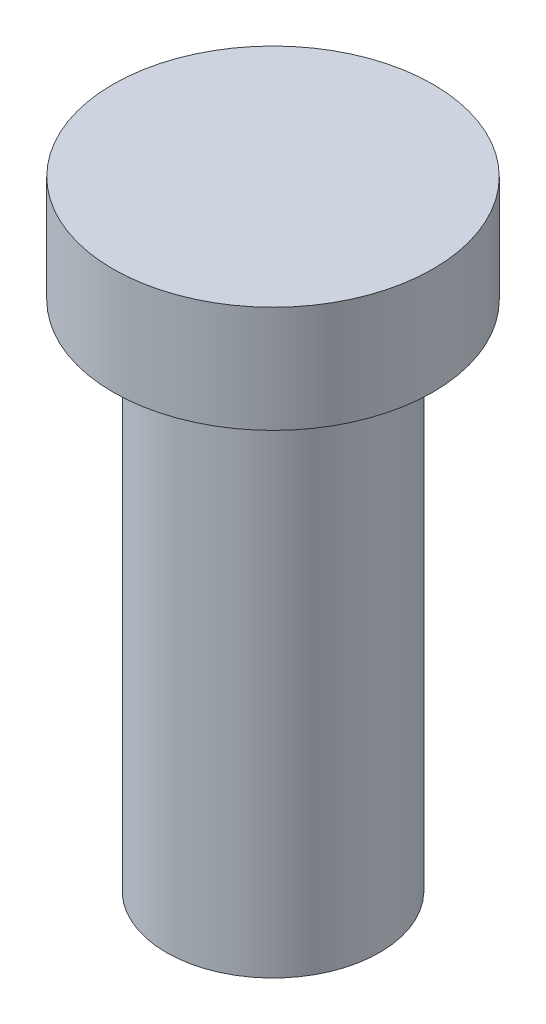
ISO-10303-21;
HEADER;
FILE_DESCRIPTION(('STEP AP214'),'2;1');
FILE_NAME('part.step','',(''),(''),'','','');
FILE_SCHEMA(('AUTOMOTIVE_DESIGN { 1 0 10303 214 1 1 1 1 }'));
ENDSEC;
DATA;
#1=APPLICATION_CONTEXT('core data for automotive mechanical design processes');
#2=APPLICATION_PROTOCOL_DEFINITION('international standard','automotive_design',2000,#1);
#3=PRODUCT_CONTEXT('',#1,'mechanical');
#4=PRODUCT('Part','Part','',(#3));
#5=PRODUCT_RELATED_PRODUCT_CATEGORY('part','',(#4));
#6=PRODUCT_DEFINITION_FORMATION('','',#4);
#7=PRODUCT_DEFINITION_CONTEXT('part definition',#1,'design');
#8=PRODUCT_DEFINITION('design','',#6,#7);
#9=PRODUCT_DEFINITION_SHAPE('','',#8);
#10=(LENGTH_UNIT() NAMED_UNIT(*) SI_UNIT(.MILLI.,.METRE.));
#11=(NAMED_UNIT(*) PLANE_ANGLE_UNIT() SI_UNIT($,.RADIAN.));
#12=(NAMED_UNIT(*) SI_UNIT($,.STERADIAN.) SOLID_ANGLE_UNIT());
#13=UNCERTAINTY_MEASURE_WITH_UNIT(LENGTH_MEASURE(1.E-05),#10,'distance_accuracy_value','');
#14=(GEOMETRIC_REPRESENTATION_CONTEXT(3) GLOBAL_UNCERTAINTY_ASSIGNED_CONTEXT((#13)) GLOBAL_UNIT_ASSIGNED_CONTEXT((#10,
#11,#12)) REPRESENTATION_CONTEXT('',''));
#15=CARTESIAN_POINT('',(0.,0.,0.));
#16=DIRECTION('',(0.,0.,1.));
#17=DIRECTION('',(1.,0.,0.));
#18=AXIS2_PLACEMENT_3D('',#15,#16,#17);
#19=CARTESIAN_POINT('',(0.,12.,0.));
#20=DIRECTION('',(0.,-1.,0.));
#21=DIRECTION('',(0.,0.,-1.));
#22=AXIS2_PLACEMENT_3D('',#19,#20,#21);
#23=CYLINDRICAL_SURFACE('',#22,2.5);
#24=CARTESIAN_POINT('',(0.,12.,0.));
#25=DIRECTION('',(0.,1.,0.));
#26=DIRECTION('',(0.,0.,1.));
#27=AXIS2_PLACEMENT_3D('',#24,#25,#26);
#28=CIRCLE('',#27,2.5);
#29=CARTESIAN_POINT('',(0.,12.,2.5));
#30=VERTEX_POINT('',#29);
#31=EDGE_CURVE('E10',#30,#30,#28,.T.);
#32=ORIENTED_EDGE('',*,*,#31,.F.);
#33=EDGE_LOOP('',(#32));
#34=FACE_BOUND('',#33,.T.);
#35=CARTESIAN_POINT('',(0.,0.,0.));
#36=DIRECTION('',(0.,1.,0.));
#37=DIRECTION('',(0.,0.,1.));
#38=AXIS2_PLACEMENT_3D('',#35,#36,#37);
#39=CIRCLE('',#38,2.5);
#40=CARTESIAN_POINT('',(0.,0.,2.5));
#41=VERTEX_POINT('',#40);
#42=EDGE_CURVE('E33',#41,#41,#39,.T.);
#43=ORIENTED_EDGE('',*,*,#42,.T.);
#44=EDGE_LOOP('',(#43));
#45=FACE_BOUND('',#44,.T.);
#46=ADVANCED_FACE('F30',(#34,#45),#23,.T.);
#47=CARTESIAN_POINT('',(0.,0.,0.));
#48=DIRECTION('',(0.,1.,0.));
#49=DIRECTION('',(0.,0.,1.));
#50=AXIS2_PLACEMENT_3D('',#47,#48,#49);
#51=PLANE('',#50);
#52=ORIENTED_EDGE('',*,*,#42,.F.);
#53=EDGE_LOOP('',(#52));
#54=FACE_BOUND('',#53,.T.);
#55=ADVANCED_FACE('F53',(#54),#51,.F.);
#56=CARTESIAN_POINT('',(0.,14.5,0.));
#57=DIRECTION('',(0.,-1.,0.));
#58=DIRECTION('',(0.,0.,-1.));
#59=AXIS2_PLACEMENT_3D('',#56,#57,#58);
#60=CYLINDRICAL_SURFACE('',#59,3.75);
#61=CARTESIAN_POINT('',(0.,14.5,0.));
#62=DIRECTION('',(0.,1.,0.));
#63=DIRECTION('',(0.,0.,1.));
#64=AXIS2_PLACEMENT_3D('',#61,#62,#63);
#65=CIRCLE('',#64,3.75);
#66=CARTESIAN_POINT('',(0.,14.5,3.75));
#67=VERTEX_POINT('',#66);
#68=EDGE_CURVE('E40',#67,#67,#65,.T.);
#69=ORIENTED_EDGE('',*,*,#68,.F.);
#70=EDGE_LOOP('',(#69));
#71=FACE_BOUND('',#70,.T.);
#72=CARTESIAN_POINT('',(0.,12.,0.));
#73=DIRECTION('',(0.,1.,0.));
#74=DIRECTION('',(0.,0.,1.));
#75=AXIS2_PLACEMENT_3D('',#72,#73,#74);
#76=CIRCLE('',#75,3.75);
#77=CARTESIAN_POINT('',(0.,12.,3.75));
#78=VERTEX_POINT('',#77);
#79=EDGE_CURVE('E42',#78,#78,#76,.T.);
#80=ORIENTED_EDGE('',*,*,#79,.T.);
#81=EDGE_LOOP('',(#80));
#82=FACE_BOUND('',#81,.T.);
#83=ADVANCED_FACE('F50',(#71,#82),#60,.T.);
#84=CARTESIAN_POINT('',(0.,14.5,0.));
#85=DIRECTION('',(0.,1.,0.));
#86=DIRECTION('',(0.,0.,1.));
#87=AXIS2_PLACEMENT_3D('',#84,#85,#86);
#88=PLANE('',#87);
#89=ORIENTED_EDGE('',*,*,#68,.T.);
#90=EDGE_LOOP('',(#89));
#91=FACE_BOUND('',#90,.T.);
#92=ADVANCED_FACE('F48',(#91),#88,.T.);
#93=CARTESIAN_POINT('',(0.,12.,0.));
#94=DIRECTION('',(0.,1.,0.));
#95=DIRECTION('',(0.,0.,1.));
#96=AXIS2_PLACEMENT_3D('',#93,#94,#95);
#97=PLANE('',#96);
#98=ORIENTED_EDGE('',*,*,#31,.T.);
#99=EDGE_LOOP('',(#98));
#100=FACE_BOUND('',#99,.T.);
#101=ORIENTED_EDGE('',*,*,#79,.F.);
#102=EDGE_LOOP('',(#101));
#103=FACE_BOUND('',#102,.T.);
#104=ADVANCED_FACE('F57',(#100,#103),#97,.F.);
#105=CLOSED_SHELL('',(#46,#55,#83,#92,#104));
#106=MANIFOLD_SOLID_BREP('B2',#105);
#107=ADVANCED_BREP_SHAPE_REPRESENTATION('',(#18,#106),#14);
#108=SHAPE_DEFINITION_REPRESENTATION(#9,#107);
ENDSEC;
END-ISO-10303-21;
